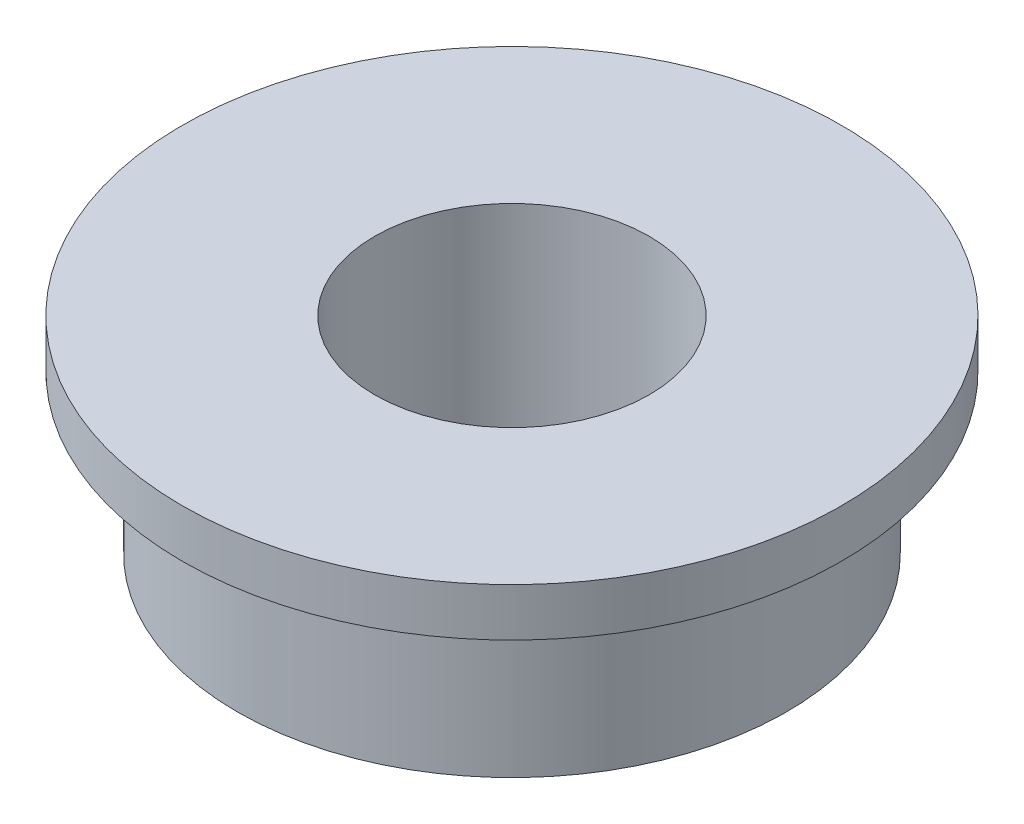
ISO-10303-21;
HEADER;
FILE_DESCRIPTION(('STEP AP214'),'2;1');
FILE_NAME('part.step','',(''),(''),'','','');
FILE_SCHEMA(('AUTOMOTIVE_DESIGN { 1 0 10303 214 1 1 1 1 }'));
ENDSEC;
DATA;
#1=APPLICATION_CONTEXT('core data for automotive mechanical design processes');
#2=APPLICATION_PROTOCOL_DEFINITION('international standard','automotive_design',2000,#1);
#3=PRODUCT_CONTEXT('',#1,'mechanical');
#4=PRODUCT('Part','Part','',(#3));
#5=PRODUCT_RELATED_PRODUCT_CATEGORY('part','',(#4));
#6=PRODUCT_DEFINITION_FORMATION('','',#4);
#7=PRODUCT_DEFINITION_CONTEXT('part definition',#1,'design');
#8=PRODUCT_DEFINITION('design','',#6,#7);
#9=PRODUCT_DEFINITION_SHAPE('','',#8);
#10=(LENGTH_UNIT() NAMED_UNIT(*) SI_UNIT(.MILLI.,.METRE.));
#11=(NAMED_UNIT(*) PLANE_ANGLE_UNIT() SI_UNIT($,.RADIAN.));
#12=(NAMED_UNIT(*) SI_UNIT($,.STERADIAN.) SOLID_ANGLE_UNIT());
#13=UNCERTAINTY_MEASURE_WITH_UNIT(LENGTH_MEASURE(1.E-05),#10,'distance_accuracy_value','');
#14=(GEOMETRIC_REPRESENTATION_CONTEXT(3) GLOBAL_UNCERTAINTY_ASSIGNED_CONTEXT((#13)) GLOBAL_UNIT_ASSIGNED_CONTEXT((#10,
#11,#12)) REPRESENTATION_CONTEXT('',''));
#15=CARTESIAN_POINT('',(0.,0.,0.));
#16=DIRECTION('',(0.,0.,1.));
#17=DIRECTION('',(1.,0.,0.));
#18=AXIS2_PLACEMENT_3D('',#15,#16,#17);
#19=CARTESIAN_POINT('',(0.,3.,0.));
#20=DIRECTION('',(0.,-1.,0.));
#21=DIRECTION('',(0.,0.,-1.));
#22=AXIS2_PLACEMENT_3D('',#19,#20,#21);
#23=CYLINDRICAL_SURFACE('',#22,4.);
#24=CARTESIAN_POINT('',(0.,0.,0.));
#25=DIRECTION('',(0.,1.,0.));
#26=DIRECTION('',(0.,0.,1.));
#27=AXIS2_PLACEMENT_3D('',#24,#25,#26);
#28=CIRCLE('',#27,4.);
#29=CARTESIAN_POINT('',(0.,0.,4.));
#30=VERTEX_POINT('',#29);
#31=EDGE_CURVE('E34',#30,#30,#28,.T.);
#32=ORIENTED_EDGE('',*,*,#31,.T.);
#33=EDGE_LOOP('',(#32));
#34=FACE_BOUND('',#33,.T.);
#35=CARTESIAN_POINT('',(0.,2.3,0.));
#36=DIRECTION('',(0.,1.,0.));
#37=DIRECTION('',(0.,0.,1.));
#38=AXIS2_PLACEMENT_3D('',#35,#36,#37);
#39=CIRCLE('',#38,4.);
#40=CARTESIAN_POINT('',(0.,2.3,4.));
#41=VERTEX_POINT('',#40);
#42=EDGE_CURVE('E10',#41,#41,#39,.T.);
#43=ORIENTED_EDGE('',*,*,#42,.F.);
#44=EDGE_LOOP('',(#43));
#45=FACE_BOUND('',#44,.T.);
#46=ADVANCED_FACE('F28',(#34,#45),#23,.T.);
#47=CARTESIAN_POINT('',(0.,3.,0.));
#48=DIRECTION('',(0.,1.,0.));
#49=DIRECTION('',(0.,0.,1.));
#50=AXIS2_PLACEMENT_3D('',#47,#48,#49);
#51=PLANE('',#50);
#52=CARTESIAN_POINT('',(0.,3.,0.));
#53=DIRECTION('',(0.,1.,0.));
#54=DIRECTION('',(0.,0.,1.));
#55=AXIS2_PLACEMENT_3D('',#52,#53,#54);
#56=CIRCLE('',#55,4.8);
#57=CARTESIAN_POINT('',(0.,3.,4.8));
#58=VERTEX_POINT('',#57);
#59=EDGE_CURVE('E48',#58,#58,#56,.T.);
#60=ORIENTED_EDGE('',*,*,#59,.T.);
#61=EDGE_LOOP('',(#60));
#62=FACE_BOUND('',#61,.T.);
#63=CARTESIAN_POINT('',(0.,3.,0.));
#64=DIRECTION('',(0.,1.,0.));
#65=DIRECTION('',(0.,0.,1.));
#66=AXIS2_PLACEMENT_3D('',#63,#64,#65);
#67=CIRCLE('',#66,2.);
#68=CARTESIAN_POINT('',(0.,3.,2.));
#69=VERTEX_POINT('',#68);
#70=EDGE_CURVE('E38',#69,#69,#67,.T.);
#71=ORIENTED_EDGE('',*,*,#70,.F.);
#72=EDGE_LOOP('',(#71));
#73=FACE_BOUND('',#72,.T.);
#74=ADVANCED_FACE('F70',(#62,#73),#51,.T.);
#75=CARTESIAN_POINT('',(0.,0.,0.));
#76=DIRECTION('',(0.,1.,0.));
#77=DIRECTION('',(0.,0.,1.));
#78=AXIS2_PLACEMENT_3D('',#75,#76,#77);
#79=PLANE('',#78);
#80=ORIENTED_EDGE('',*,*,#31,.F.);
#81=EDGE_LOOP('',(#80));
#82=FACE_BOUND('',#81,.T.);
#83=CARTESIAN_POINT('',(0.,0.,0.));
#84=DIRECTION('',(0.,1.,0.));
#85=DIRECTION('',(0.,0.,1.));
#86=AXIS2_PLACEMENT_3D('',#83,#84,#85);
#87=CIRCLE('',#86,2.);
#88=CARTESIAN_POINT('',(0.,0.,2.));
#89=VERTEX_POINT('',#88);
#90=EDGE_CURVE('E42',#89,#89,#87,.T.);
#91=ORIENTED_EDGE('',*,*,#90,.T.);
#92=EDGE_LOOP('',(#91));
#93=FACE_BOUND('',#92,.T.);
#94=ADVANCED_FACE('F66',(#82,#93),#79,.F.);
#95=CARTESIAN_POINT('',(0.,3.,0.));
#96=DIRECTION('',(0.,-1.,0.));
#97=DIRECTION('',(0.,0.,-1.));
#98=AXIS2_PLACEMENT_3D('',#95,#96,#97);
#99=CYLINDRICAL_SURFACE('',#98,2.);
#100=ORIENTED_EDGE('',*,*,#70,.T.);
#101=EDGE_LOOP('',(#100));
#102=FACE_BOUND('',#101,.T.);
#103=ORIENTED_EDGE('',*,*,#90,.F.);
#104=EDGE_LOOP('',(#103));
#105=FACE_BOUND('',#104,.T.);
#106=ADVANCED_FACE('F59',(#102,#105),#99,.F.);
#107=CARTESIAN_POINT('',(0.,2.3,0.));
#108=DIRECTION('',(0.,1.,0.));
#109=DIRECTION('',(0.,0.,1.));
#110=AXIS2_PLACEMENT_3D('',#107,#108,#109);
#111=PLANE('',#110);
#112=CARTESIAN_POINT('',(0.,2.3,0.));
#113=DIRECTION('',(0.,1.,0.));
#114=DIRECTION('',(0.,0.,1.));
#115=AXIS2_PLACEMENT_3D('',#112,#113,#114);
#116=CIRCLE('',#115,4.8);
#117=CARTESIAN_POINT('',(0.,2.3,4.8));
#118=VERTEX_POINT('',#117);
#119=EDGE_CURVE('E46',#118,#118,#116,.T.);
#120=ORIENTED_EDGE('',*,*,#119,.F.);
#121=EDGE_LOOP('',(#120));
#122=FACE_BOUND('',#121,.T.);
#123=ORIENTED_EDGE('',*,*,#42,.T.);
#124=EDGE_LOOP('',(#123));
#125=FACE_BOUND('',#124,.T.);
#126=ADVANCED_FACE('F57',(#122,#125),#111,.F.);
#127=CARTESIAN_POINT('',(0.,2.3,0.));
#128=DIRECTION('',(0.,1.,0.));
#129=DIRECTION('',(0.,0.,1.));
#130=AXIS2_PLACEMENT_3D('',#127,#128,#129);
#131=CYLINDRICAL_SURFACE('',#130,4.8);
#132=ORIENTED_EDGE('',*,*,#119,.T.);
#133=EDGE_LOOP('',(#132));
#134=FACE_BOUND('',#133,.T.);
#135=ORIENTED_EDGE('',*,*,#59,.F.);
#136=EDGE_LOOP('',(#135));
#137=FACE_BOUND('',#136,.T.);
#138=ADVANCED_FACE('F54',(#134,#137),#131,.T.);
#139=CLOSED_SHELL('',(#46,#74,#94,#106,#126,#138));
#140=MANIFOLD_SOLID_BREP('B2',#139);
#141=ADVANCED_BREP_SHAPE_REPRESENTATION('',(#18,#140),#14);
#142=SHAPE_DEFINITION_REPRESENTATION(#9,#141);
ENDSEC;
END-ISO-10303-21;
